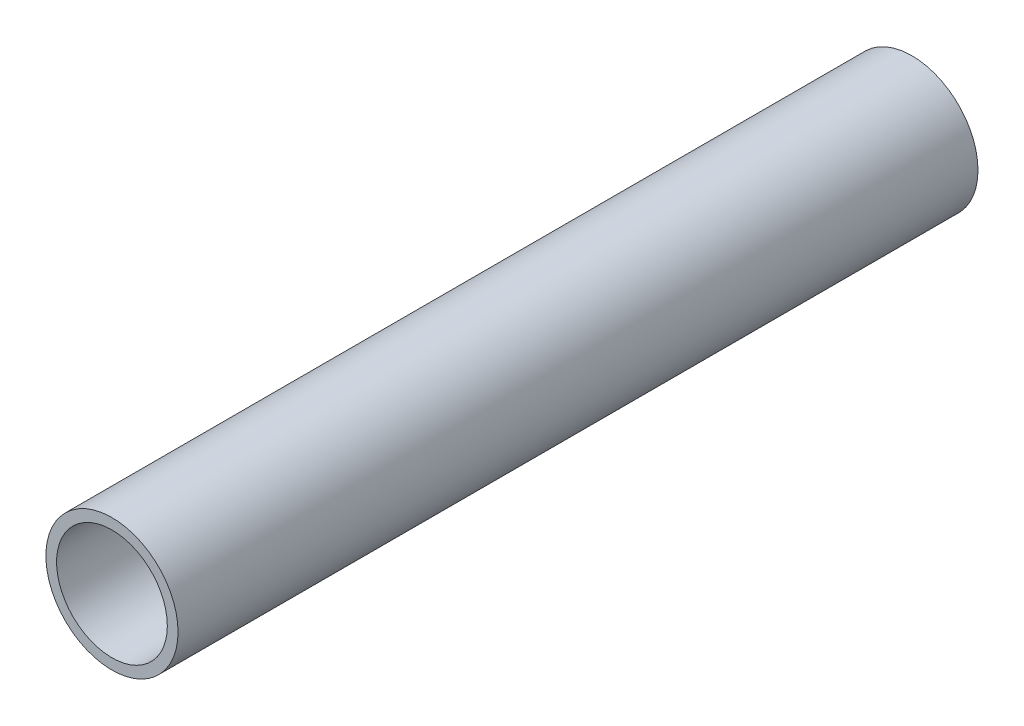
ISO-10303-21;
HEADER;
FILE_DESCRIPTION(('STEP AP214'),'2;1');
FILE_NAME('part.step','',(''),(''),'','','');
FILE_SCHEMA(('AUTOMOTIVE_DESIGN { 1 0 10303 214 1 1 1 1 }'));
ENDSEC;
DATA;
#1=APPLICATION_CONTEXT('core data for automotive mechanical design processes');
#2=APPLICATION_PROTOCOL_DEFINITION('international standard','automotive_design',2000,#1);
#3=PRODUCT_CONTEXT('',#1,'mechanical');
#4=PRODUCT('Part','Part','',(#3));
#5=PRODUCT_RELATED_PRODUCT_CATEGORY('part','',(#4));
#6=PRODUCT_DEFINITION_FORMATION('','',#4);
#7=PRODUCT_DEFINITION_CONTEXT('part definition',#1,'design');
#8=PRODUCT_DEFINITION('design','',#6,#7);
#9=PRODUCT_DEFINITION_SHAPE('','',#8);
#10=(LENGTH_UNIT() NAMED_UNIT(*) SI_UNIT(.MILLI.,.METRE.));
#11=(NAMED_UNIT(*) PLANE_ANGLE_UNIT() SI_UNIT($,.RADIAN.));
#12=(NAMED_UNIT(*) SI_UNIT($,.STERADIAN.) SOLID_ANGLE_UNIT());
#13=UNCERTAINTY_MEASURE_WITH_UNIT(LENGTH_MEASURE(1.E-05),#10,'distance_accuracy_value','');
#14=(GEOMETRIC_REPRESENTATION_CONTEXT(3) GLOBAL_UNCERTAINTY_ASSIGNED_CONTEXT((#13)) GLOBAL_UNIT_ASSIGNED_CONTEXT((#10,
#11,#12)) REPRESENTATION_CONTEXT('',''));
#15=CARTESIAN_POINT('',(0.,0.,0.));
#16=DIRECTION('',(0.,0.,1.));
#17=DIRECTION('',(1.,0.,0.));
#18=AXIS2_PLACEMENT_3D('',#15,#16,#17);
#19=CARTESIAN_POINT('',(-325.637336551959,52.4749999999989,-292.100000000003));
#20=DIRECTION('',(0.,0.,1.));
#21=DIRECTION('',(1.,0.,0.));
#22=AXIS2_PLACEMENT_3D('',#19,#20,#21);
#23=CYLINDRICAL_SURFACE('',#22,24.13);
#24=CARTESIAN_POINT('',(-325.637336551959,28.3449999999997,-53.9750000000048));
#25=CARTESIAN_POINT('',(-325.459818091288,28.3450025809268,-53.9749925082069));
#26=CARTESIAN_POINT('',(-325.28219064364,28.3469795891877,-53.9600618469458));
#27=CARTESIAN_POINT('',(-324.931883969958,28.3546760763637,-53.900739295128));
#28=CARTESIAN_POINT('',(-324.759210015163,28.3603993981656,-53.8563171521855));
#29=CARTESIAN_POINT('',(-324.423932015443,28.3749441395772,-53.7393477650123));
#30=CARTESIAN_POINT('',(-324.261321076704,28.3837634099955,-53.6668200279206));
#31=CARTESIAN_POINT('',(-323.950607923482,28.4035207348482,-53.4957422012726));
#32=CARTESIAN_POINT('',(-323.802503342963,28.4144584428887,-53.3971963650799));
#33=CARTESIAN_POINT('',(-323.524078031622,28.4373069469014,-53.1762403340289));
#34=CARTESIAN_POINT('',(-323.393858142176,28.4492227002004,-53.0537035692013));
#35=CARTESIAN_POINT('',(-323.155767560993,28.4726446368105,-52.7885160221119));
#36=CARTESIAN_POINT('',(-323.047898042619,28.4841507985924,-52.6458641844975));
#37=CARTESIAN_POINT('',(-322.857190190259,28.5054993413241,-52.3438347310911));
#38=CARTESIAN_POINT('',(-322.774447133869,28.5153353284868,-52.1843964640556));
#39=CARTESIAN_POINT('',(-322.6369495345,28.5321638027671,-51.8537359032831));
#40=CARTESIAN_POINT('',(-322.582193817437,28.5391564091635,-51.6825141042135));
#41=CARTESIAN_POINT('',(-322.502533409425,28.5494586349159,-51.3341972693994));
#42=CARTESIAN_POINT('',(-322.47745779969,28.5527893341109,-51.1571419574309));
#43=CARTESIAN_POINT('',(-322.457340377754,28.5554549917042,-50.8013073652497));
#44=CARTESIAN_POINT('',(-322.462297231484,28.554790127589,-50.6225281619659));
#45=CARTESIAN_POINT('',(-322.501963882523,28.549559070175,-50.2695157956141));
#46=CARTESIAN_POINT('',(-322.536484897098,28.5450176314487,-50.095261000624));
#47=CARTESIAN_POINT('',(-322.634005158554,28.5325837513708,-49.7550392213076));
#48=CARTESIAN_POINT('',(-322.697005039198,28.5246912354452,-49.5890724215118));
#49=CARTESIAN_POINT('',(-322.849895986417,28.5064165936053,-49.2695543243567));
#50=CARTESIAN_POINT('',(-322.939868577974,28.496026939242,-49.1160424852604));
#51=CARTESIAN_POINT('',(-323.144092701323,28.4739343907581,-48.8262245072506));
#52=CARTESIAN_POINT('',(-323.258345462822,28.4622314301372,-48.689919240348));
#53=CARTESIAN_POINT('',(-323.50893049819,28.4387210106488,-48.4372882523321));
#54=CARTESIAN_POINT('',(-323.645425393814,28.4269134387271,-48.3211237857034));
#55=CARTESIAN_POINT('',(-323.93606158404,28.4046080291005,-48.1133291727697));
#56=CARTESIAN_POINT('',(-324.090202927184,28.3941101949986,-48.0216990939552));
#57=CARTESIAN_POINT('',(-324.411884650194,28.3755995456255,-47.8655721796682));
#58=CARTESIAN_POINT('',(-324.579430269716,28.367587708145,-47.8010860168778));
#59=CARTESIAN_POINT('',(-324.923100831293,28.3549604337208,-47.7012084538364));
#60=CARTESIAN_POINT('',(-325.099225327509,28.350344820478,-47.6658155433342));
#61=CARTESIAN_POINT('',(-325.453660463131,28.3450530687133,-47.6253394904736));
#62=CARTESIAN_POINT('',(-325.631945333404,28.3443480735785,-47.6200343228712));
#63=CARTESIAN_POINT('',(-325.986861716846,28.3468789226747,-47.6392975871726));
#64=CARTESIAN_POINT('',(-326.163493269024,28.3501146736897,-47.6638653124515));
#65=CARTESIAN_POINT('',(-326.509429688578,28.3601455094139,-47.7419924749744));
#66=CARTESIAN_POINT('',(-326.678759004293,28.3669275243541,-47.7954454794534));
#67=CARTESIAN_POINT('',(-327.00605071904,28.3832919628254,-47.9297148226547));
#68=CARTESIAN_POINT('',(-327.164012694292,28.3928744906935,-48.0105321808907));
#69=CARTESIAN_POINT('',(-327.46507360711,28.4138444288795,-48.1977692822176));
#70=CARTESIAN_POINT('',(-327.608082942688,28.4252417902957,-48.3043319635166));
#71=CARTESIAN_POINT('',(-327.874266075466,28.4485368168047,-48.5398333672655));
#72=CARTESIAN_POINT('',(-327.997438996234,28.4604345039741,-48.6687730778738));
#73=CARTESIAN_POINT('',(-328.221245597148,28.4834788887001,-48.9463490537979));
#74=CARTESIAN_POINT('',(-328.321731683275,28.4946203563181,-49.0951048207546));
#75=CARTESIAN_POINT('',(-328.49629101121,28.514803141617,-49.4075131690926));
#76=CARTESIAN_POINT('',(-328.570364830005,28.523844505174,-49.5711654249555));
#77=CARTESIAN_POINT('',(-328.689760477435,28.5387671571531,-49.9082539491069));
#78=CARTESIAN_POINT('',(-328.735164151697,28.544657433666,-50.0816608129311));
#79=CARTESIAN_POINT('',(-328.796193539955,28.5526362892943,-50.4337203738645));
#80=CARTESIAN_POINT('',(-328.811820801745,28.5547250660134,-50.6123727978167));
#81=CARTESIAN_POINT('',(-328.812823288514,28.5548582497904,-50.9683832267383));
#82=CARTESIAN_POINT('',(-328.798430423827,28.5529336607729,-51.1457406114687));
#83=CARTESIAN_POINT('',(-328.740293759257,28.5453237990389,-51.4954913884167));
#84=CARTESIAN_POINT('',(-328.696549967198,28.5396385273248,-51.6678847819572));
#85=CARTESIAN_POINT('',(-328.581028083339,28.5251577848448,-52.002775065993));
#86=CARTESIAN_POINT('',(-328.509262418995,28.5163636929769,-52.1652763066948));
#87=CARTESIAN_POINT('',(-328.339756743501,28.4966540692591,-52.475967849785));
#88=CARTESIAN_POINT('',(-328.242016268634,28.4857384995364,-52.6241578966182));
#89=CARTESIAN_POINT('',(-328.022479210214,28.4629149274235,-52.9032043717282));
#90=CARTESIAN_POINT('',(-327.900509992928,28.4510001798414,-53.0339244415616));
#91=CARTESIAN_POINT('',(-327.636339854731,28.427579522979,-53.2731287135579));
#92=CARTESIAN_POINT('',(-327.494134189428,28.4160737103654,-53.381607686746));
#93=CARTESIAN_POINT('',(-327.192836095995,28.3947132903074,-53.5736447436199));
#94=CARTESIAN_POINT('',(-327.033675138078,28.3848658335742,-53.6570960584987));
#95=CARTESIAN_POINT('',(-326.703553587724,28.3680033383632,-53.7959646723369));
#96=CARTESIAN_POINT('',(-326.532605895658,28.3609852590454,-53.8514120844523));
#97=CARTESIAN_POINT('',(-326.240223894528,28.3522421558295,-53.9195956483082));
#98=CARTESIAN_POINT('',(-326.120624491511,28.3495397525192,-53.9403419628565));
#99=CARTESIAN_POINT('',(-325.879812519362,28.3459178006605,-53.9680466389509));
#100=CARTESIAN_POINT('',(-325.758599963949,28.3449982369604,-53.9750051176751));
#101=CARTESIAN_POINT('',(-325.637336551959,28.3449999999997,-53.9750000000048));
#102=B_SPLINE_CURVE_WITH_KNOTS('',3,(#24,#25,#26,#27,#28,#29,#30,#31,#32,#33,#34,#35,#36,#37,
#38,#39,#40,#41,#42,#43,#44,#45,#46,#47,#48,#49,#50,#51,#52,#53,#54,#55,#56,#57,#58,#59,#60,#61,
#62,#63,#64,#65,#66,#67,#68,#69,#70,#71,#72,#73,#74,#75,#76,#77,#78,#79,#80,#81,#82,#83,#84,#85,
#86,#87,#88,#89,#90,#91,#92,#93,#94,#95,#96,#97,#98,#99,#100,#101),.UNSPECIFIED.,.T.,.F.,(4,2,2,
2,2,2,2,2,2,2,2,2,2,2,2,2,2,2,2,2,2,2,2,2,2,2,2,2,2,2,2,2,2,2,2,2,2,2,4),(0.,0.532112403833518,
1.06477149414484,1.59706154411332,2.12926463066764,2.6643550611331,3.19947357597909,
3.73659658472221,4.27369705902272,4.80768924772236,5.34165771618489,5.8722417230875,
6.40283753806474,6.93505353031331,7.46729648388722,8.0036215643771,8.53994812020476,
9.07648535705787,9.61299474012437,10.1455398783179,10.6780724197284,11.2086560015707,
11.7392593535406,12.2728791985634,12.8065226139713,13.343543664941,13.8805529837315,
14.4160222695977,14.9514637207359,15.4827841248097,16.0141043872783,16.5451892810055,
17.0762836565789,17.6113074445635,18.1464568750005,18.6838578173005,19.2206796446554,
19.5841703700491,19.9476580062469),.UNSPECIFIED.);
#103=CARTESIAN_POINT('',(-325.637336551959,28.3449999999997,-53.9750000000048));
#104=VERTEX_POINT('',#103);
#105=EDGE_CURVE('E109',#104,#104,#102,.T.);
#106=ORIENTED_EDGE('',*,*,#105,.F.);
#107=EDGE_LOOP('',(#106));
#108=FACE_BOUND('',#107,.T.);
#109=CARTESIAN_POINT('',(-325.637336551959,28.3449999999991,-244.475000000002));
#110=CARTESIAN_POINT('',(-325.459818091288,28.3450025809262,-244.474992508204));
#111=CARTESIAN_POINT('',(-325.28219064364,28.3469795891872,-244.460061846946));
#112=CARTESIAN_POINT('',(-324.931883969958,28.3546760763633,-244.400739295129));
#113=CARTESIAN_POINT('',(-324.759210015163,28.360399398165,-244.356317152185));
#114=CARTESIAN_POINT('',(-324.423932015444,28.3749441395766,-244.239347765011));
#115=CARTESIAN_POINT('',(-324.261321076704,28.383763409995,-244.166820027921));
#116=CARTESIAN_POINT('',(-323.950607923482,28.4035207348477,-243.995742201275));
#117=CARTESIAN_POINT('',(-323.802503342963,28.4144584428882,-243.897196365083));
#118=CARTESIAN_POINT('',(-323.524078031623,28.437306946901,-243.676240334032));
#119=CARTESIAN_POINT('',(-323.393858142176,28.4492227001999,-243.553703569204));
#120=CARTESIAN_POINT('',(-323.155767560993,28.47264463681,-243.288516022113));
#121=CARTESIAN_POINT('',(-323.04789804262,28.4841507985919,-243.145864184498));
#122=CARTESIAN_POINT('',(-322.857190190259,28.5054993413236,-242.843834731091));
#123=CARTESIAN_POINT('',(-322.774447133868,28.5153353284864,-242.684396464056));
#124=CARTESIAN_POINT('',(-322.636949534499,28.5321638027668,-242.353735903283));
#125=CARTESIAN_POINT('',(-322.582193817437,28.5391564091631,-242.182514104213));
#126=CARTESIAN_POINT('',(-322.502533409425,28.5494586349154,-241.834197269399));
#127=CARTESIAN_POINT('',(-322.477457799689,28.5527893341104,-241.657141957431));
#128=CARTESIAN_POINT('',(-322.457340377753,28.555454991704,-241.30130736525));
#129=CARTESIAN_POINT('',(-322.462297231484,28.554790127589,-241.122528161966));
#130=CARTESIAN_POINT('',(-322.501963882523,28.5495590701749,-240.769515795614));
#131=CARTESIAN_POINT('',(-322.536484897098,28.5450176314484,-240.595261000624));
#132=CARTESIAN_POINT('',(-322.634005158554,28.5325837513703,-240.255039221307));
#133=CARTESIAN_POINT('',(-322.697005039197,28.524691235445,-240.089072421511));
#134=CARTESIAN_POINT('',(-322.849895986416,28.5064165936051,-239.769554324356));
#135=CARTESIAN_POINT('',(-322.939868577973,28.4960269392416,-239.616042485261));
#136=CARTESIAN_POINT('',(-323.144092701323,28.4739343907576,-239.326224507252));
#137=CARTESIAN_POINT('',(-323.258345462822,28.4622314301369,-239.18991924035));
#138=CARTESIAN_POINT('',(-323.50893049819,28.4387210106485,-238.937288252334));
#139=CARTESIAN_POINT('',(-323.645425393813,28.4269134387267,-238.821123785704));
#140=CARTESIAN_POINT('',(-323.936061584039,28.4046080291001,-238.613329172771));
#141=CARTESIAN_POINT('',(-324.090202927184,28.3941101949983,-238.521699093958));
#142=CARTESIAN_POINT('',(-324.411884650195,28.3755995456251,-238.365572179671));
#143=CARTESIAN_POINT('',(-324.579430269716,28.3675877081445,-238.301086016879));
#144=CARTESIAN_POINT('',(-324.923100831293,28.3549604337204,-238.201208453837));
#145=CARTESIAN_POINT('',(-325.09922532751,28.3503448204777,-238.165815543335));
#146=CARTESIAN_POINT('',(-325.453660463132,28.345053068713,-238.125339490475));
#147=CARTESIAN_POINT('',(-325.631945333404,28.344348073578,-238.120034322873));
#148=CARTESIAN_POINT('',(-325.986861716846,28.3468789226742,-238.139297587173));
#149=CARTESIAN_POINT('',(-326.163493269024,28.3501146736896,-238.16386531245));
#150=CARTESIAN_POINT('',(-326.509429688577,28.3601455094139,-238.241992474973));
#151=CARTESIAN_POINT('',(-326.678759004293,28.3669275243536,-238.295445479454));
#152=CARTESIAN_POINT('',(-327.00605071904,28.3832919628248,-238.429714822656));
#153=CARTESIAN_POINT('',(-327.164012694292,28.3928744906932,-238.510532180893));
#154=CARTESIAN_POINT('',(-327.46507360711,28.4138444288792,-238.69776928222));
#155=CARTESIAN_POINT('',(-327.608082942689,28.4252417902952,-238.804331963518));
#156=CARTESIAN_POINT('',(-327.874266075466,28.4485368168042,-239.039833367267));
#157=CARTESIAN_POINT('',(-327.997438996235,28.4604345039738,-239.168773077876));
#158=CARTESIAN_POINT('',(-328.221245597148,28.4834788886998,-239.4463490538));
#159=CARTESIAN_POINT('',(-328.321731683275,28.4946203563176,-239.595104820756));
#160=CARTESIAN_POINT('',(-328.496291011209,28.5148031416164,-239.907513169094));
#161=CARTESIAN_POINT('',(-328.570364830005,28.5238445051735,-240.071165424957));
#162=CARTESIAN_POINT('',(-328.689760477435,28.5387671571525,-240.408253949108));
#163=CARTESIAN_POINT('',(-328.735164151696,28.5446574336653,-240.581660812932));
#164=CARTESIAN_POINT('',(-328.796193539955,28.5526362892937,-240.933720373865));
#165=CARTESIAN_POINT('',(-328.811820801745,28.5547250660128,-241.112372797817));
#166=CARTESIAN_POINT('',(-328.812823288515,28.5548582497899,-241.468383226739));
#167=CARTESIAN_POINT('',(-328.798430423827,28.5529336607723,-241.645740611469));
#168=CARTESIAN_POINT('',(-328.740293759257,28.5453237990383,-241.995491388416));
#169=CARTESIAN_POINT('',(-328.696549967197,28.5396385273242,-242.167884781956));
#170=CARTESIAN_POINT('',(-328.581028083338,28.5251577848443,-242.502775065992));
#171=CARTESIAN_POINT('',(-328.509262418995,28.5163636929764,-242.665276306694));
#172=CARTESIAN_POINT('',(-328.339756743501,28.4966540692586,-242.975967849785));
#173=CARTESIAN_POINT('',(-328.242016268634,28.4857384995358,-243.124157896618));
#174=CARTESIAN_POINT('',(-328.022479210214,28.4629149274229,-243.403204371728));
#175=CARTESIAN_POINT('',(-327.900509992928,28.4510001798409,-243.533924441562));
#176=CARTESIAN_POINT('',(-327.636339854731,28.4275795229785,-243.773128713558));
#177=CARTESIAN_POINT('',(-327.494134189428,28.4160737103648,-243.881607686746));
#178=CARTESIAN_POINT('',(-327.192836095996,28.3947132903068,-244.07364474362));
#179=CARTESIAN_POINT('',(-327.033675138079,28.3848658335738,-244.157096058499));
#180=CARTESIAN_POINT('',(-326.703553587724,28.3680033383627,-244.295964672337));
#181=CARTESIAN_POINT('',(-326.532605895658,28.3609852590448,-244.35141208445));
#182=CARTESIAN_POINT('',(-326.240223894528,28.352242155829,-244.419595648308));
#183=CARTESIAN_POINT('',(-326.120624491511,28.3495397525187,-244.440341962858));
#184=CARTESIAN_POINT('',(-325.879812519362,28.34591780066,-244.468046638951));
#185=CARTESIAN_POINT('',(-325.758599963949,28.3449982369598,-244.475005117673));
#186=CARTESIAN_POINT('',(-325.637336551959,28.3449999999991,-244.475000000002));
#187=B_SPLINE_CURVE_WITH_KNOTS('',3,(#109,#110,#111,#112,#113,#114,#115,#116,#117,#118,#119,
#120,#121,#122,#123,#124,#125,#126,#127,#128,#129,#130,#131,#132,#133,#134,#135,#136,#137,#138,
#139,#140,#141,#142,#143,#144,#145,#146,#147,#148,#149,#150,#151,#152,#153,#154,#155,#156,#157,
#158,#159,#160,#161,#162,#163,#164,#165,#166,#167,#168,#169,#170,#171,#172,#173,#174,#175,#176,
#177,#178,#179,#180,#181,#182,#183,#184,#185,#186),.UNSPECIFIED.,.T.,.F.,(4,2,2,2,2,2,2,2,2,2,2,
2,2,2,2,2,2,2,2,2,2,2,2,2,2,2,2,2,2,2,2,2,2,2,2,2,2,2,4),(0.,0.532112403833292,1.06477149414452,
1.59706154411174,2.12926463066459,2.66435506113141,3.19947357597899,3.73659658472252,
4.27369705902306,4.80768924772265,5.34165771618534,5.87224172308816,6.40283753806534,
6.93505353031295,7.46729648388623,8.00362156437619,8.5399481202038,9.07648535705736,
9.61299474012445,10.1455398783175,10.678072419727,11.2086560015702,11.7392593535412,
12.2728791985639,12.8065226139716,13.343543664941,13.8805529837312,14.4160222695971,
14.9514637207348,15.4827841248079,16.0141043872759,16.5451892810033,17.0762836565769,
17.6113074445612,18.1464568749979,18.683857817298,19.220679644653,19.5841703700469,
19.9476580062451),.UNSPECIFIED.);
#188=CARTESIAN_POINT('',(-325.637336551959,28.3449999999991,-244.475000000002));
#189=VERTEX_POINT('',#188);
#190=EDGE_CURVE('E62',#189,#189,#187,.T.);
#191=ORIENTED_EDGE('',*,*,#190,.F.);
#192=EDGE_LOOP('',(#191));
#193=FACE_BOUND('',#192,.T.);
#194=CARTESIAN_POINT('',(-325.637336551959,52.4749999999989,-292.100000000003));
#195=DIRECTION('',(0.,0.,1.));
#196=DIRECTION('',(1.,0.,0.));
#197=AXIS2_PLACEMENT_3D('',#194,#195,#196);
#198=CIRCLE('',#197,24.13);
#199=CARTESIAN_POINT('',(-301.507336551959,52.4749999999989,-292.100000000003));
#200=VERTEX_POINT('',#199);
#201=EDGE_CURVE('E12',#200,#200,#198,.T.);
#202=ORIENTED_EDGE('',*,*,#201,.T.);
#203=EDGE_LOOP('',(#202));
#204=FACE_BOUND('',#203,.T.);
#205=CARTESIAN_POINT('',(-325.637336551959,52.4749999999999,-2.66453525910038E-12));
#206=DIRECTION('',(0.,0.,1.));
#207=DIRECTION('',(1.,0.,0.));
#208=AXIS2_PLACEMENT_3D('',#205,#206,#207);
#209=CIRCLE('',#208,24.13);
#210=CARTESIAN_POINT('',(-301.507336551959,52.4749999999999,-2.62435073672407E-12));
#211=VERTEX_POINT('',#210);
#212=EDGE_CURVE('E50',#211,#211,#209,.T.);
#213=ORIENTED_EDGE('',*,*,#212,.F.);
#214=EDGE_LOOP('',(#213));
#215=FACE_BOUND('',#214,.T.);
#216=ADVANCED_FACE('F46',(#108,#193,#204,#215),#23,.T.);
#217=CARTESIAN_POINT('',(-325.637336551959,52.4749999999989,-292.100000000003));
#218=DIRECTION('',(0.,0.,1.));
#219=DIRECTION('',(1.,0.,0.));
#220=AXIS2_PLACEMENT_3D('',#217,#218,#219);
#221=PLANE('',#220);
#222=CARTESIAN_POINT('',(-325.637336551959,52.4749999999989,-292.100000000003));
#223=DIRECTION('',(0.,0.,1.));
#224=DIRECTION('',(1.,0.,0.));
#225=AXIS2_PLACEMENT_3D('',#222,#223,#224);
#226=CIRCLE('',#225,20.2184);
#227=CARTESIAN_POINT('',(-305.418936551959,52.4749999999989,-292.100000000003));
#228=VERTEX_POINT('',#227);
#229=EDGE_CURVE('E57',#228,#228,#226,.T.);
#230=ORIENTED_EDGE('',*,*,#229,.T.);
#231=EDGE_LOOP('',(#230));
#232=FACE_BOUND('',#231,.T.);
#233=ORIENTED_EDGE('',*,*,#201,.F.);
#234=EDGE_LOOP('',(#233));
#235=FACE_BOUND('',#234,.T.);
#236=ADVANCED_FACE('F93',(#232,#235),#221,.F.);
#237=CARTESIAN_POINT('',(-325.637336551959,52.4749999999999,-2.66453525910038E-12));
#238=DIRECTION('',(0.,0.,1.));
#239=DIRECTION('',(1.,0.,0.));
#240=AXIS2_PLACEMENT_3D('',#237,#238,#239);
#241=PLANE('',#240);
#242=CARTESIAN_POINT('',(-325.637336551959,52.4749999999999,-2.66453525910038E-12));
#243=DIRECTION('',(0.,0.,1.));
#244=DIRECTION('',(1.,0.,0.));
#245=AXIS2_PLACEMENT_3D('',#242,#243,#244);
#246=CIRCLE('',#245,20.2184);
#247=CARTESIAN_POINT('',(-305.418936551959,52.4749999999999,-2.63086485929875E-12));
#248=VERTEX_POINT('',#247);
#249=EDGE_CURVE('E59',#248,#248,#246,.T.);
#250=ORIENTED_EDGE('',*,*,#249,.F.);
#251=EDGE_LOOP('',(#250));
#252=FACE_BOUND('',#251,.T.);
#253=ORIENTED_EDGE('',*,*,#212,.T.);
#254=EDGE_LOOP('',(#253));
#255=FACE_BOUND('',#254,.T.);
#256=ADVANCED_FACE('F91',(#252,#255),#241,.T.);
#257=CARTESIAN_POINT('',(-325.637336551959,52.4749999999989,-292.100000000003));
#258=DIRECTION('',(0.,0.,1.));
#259=DIRECTION('',(1.,0.,0.));
#260=AXIS2_PLACEMENT_3D('',#257,#258,#259);
#261=CYLINDRICAL_SURFACE('',#260,20.2184);
#262=CARTESIAN_POINT('',(-325.637336551958,32.2565999999996,-53.9750000000032));
#263=CARTESIAN_POINT('',(-325.460163926135,32.2566029278112,-53.9749927729527));
#264=CARTESIAN_POINT('',(-325.282890994419,32.2589531752092,-53.9601199337363));
#265=CARTESIAN_POINT('',(-324.933307103764,32.2681025349986,-53.9010405616043));
#266=CARTESIAN_POINT('',(-324.761001029207,32.2749058805131,-53.8568061169279));
#267=CARTESIAN_POINT('',(-324.426460038746,32.2921974903296,-53.7403637114216));
#268=CARTESIAN_POINT('',(-324.264217367896,32.3026828746448,-53.6681776090708));
#269=CARTESIAN_POINT('',(-323.954170524735,32.3261822834479,-53.4979359997102));
#270=CARTESIAN_POINT('',(-323.80636449619,32.3391959822053,-53.3998838245244));
#271=CARTESIAN_POINT('',(-323.52810278189,32.3664308223716,-53.1798028963141));
#272=CARTESIAN_POINT('',(-323.397788091089,32.3806604193125,-53.0575969022331));
#273=CARTESIAN_POINT('',(-323.159425288927,32.4086577136854,-52.793058782916));
#274=CARTESIAN_POINT('',(-323.051378508131,32.4224253834749,-52.6507254558755));
#275=CARTESIAN_POINT('',(-322.86006299503,32.4480219532804,-52.3490168418114));
#276=CARTESIAN_POINT('',(-322.776931926172,32.4598399252378,-52.1895532536991));
#277=CARTESIAN_POINT('',(-322.638687608347,32.4800827747638,-51.8587096552949));
#278=CARTESIAN_POINT('',(-322.583572683668,32.4885078552631,-51.687330358407));
#279=CARTESIAN_POINT('',(-322.503365689871,32.5009274217515,-51.3390079856382));
#280=CARTESIAN_POINT('',(-322.478031376898,32.504957637084,-51.1621219879604));
#281=CARTESIAN_POINT('',(-322.457354046068,32.5082394610721,-50.8065671746675));
#282=CARTESIAN_POINT('',(-322.46200914278,32.5074913701396,-50.6278984718361));
#283=CARTESIAN_POINT('',(-322.50098079188,32.5013337586338,-50.2755685914442));
#284=CARTESIAN_POINT('',(-322.53502659543,32.4959667888167,-50.1018766147861));
#285=CARTESIAN_POINT('',(-322.631388955247,32.4812426661879,-49.7627013433261));
#286=CARTESIAN_POINT('',(-322.693706381222,32.4718853906244,-49.5972183012266));
#287=CARTESIAN_POINT('',(-322.845121703211,32.450188407732,-49.2783400129539));
#288=CARTESIAN_POINT('',(-322.934333356176,32.4378360762546,-49.1249996770369));
#289=CARTESIAN_POINT('',(-323.136923829292,32.411549750937,-48.8353625964443));
#290=CARTESIAN_POINT('',(-323.250304385233,32.3976156435285,-48.6990670770295));
#291=CARTESIAN_POINT('',(-323.499495880634,32.3695482058583,-48.445820185739));
#292=CARTESIAN_POINT('',(-323.635539405683,32.3554143678663,-48.3290976099266));
#293=CARTESIAN_POINT('',(-323.925404854859,32.3286817886918,-48.120104580233));
#294=CARTESIAN_POINT('',(-324.079226870962,32.3160830554519,-48.0278342528643));
#295=CARTESIAN_POINT('',(-324.400488059776,32.2938251868537,-47.8703494732774));
#296=CARTESIAN_POINT('',(-324.567936549148,32.2841680845054,-47.8051537214943));
#297=CARTESIAN_POINT('',(-324.911591320664,32.2688982714988,-47.7038731551662));
#298=CARTESIAN_POINT('',(-325.087796952265,32.2632852608958,-47.6677861816403));
#299=CARTESIAN_POINT('',(-325.441990600833,32.2567760390099,-47.6260542108351));
#300=CARTESIAN_POINT('',(-325.619940716437,32.2558311220744,-47.620094854612));
#301=CARTESIAN_POINT('',(-325.974298120094,32.258631636747,-47.6379513657856));
#302=CARTESIAN_POINT('',(-326.150705460435,32.2623769087684,-47.6617662200963));
#303=CARTESIAN_POINT('',(-326.496009853419,32.2741068492996,-47.7382336973156));
#304=CARTESIAN_POINT('',(-326.664941883485,32.2820688464866,-47.7907321495128));
#305=CARTESIAN_POINT('',(-326.991606502537,32.3013426874425,-47.9229132790336));
#306=CARTESIAN_POINT('',(-327.149338522024,32.3126547014023,-48.0025973374979));
#307=CARTESIAN_POINT('',(-327.450501112754,32.3374933922157,-48.1876180557335));
#308=CARTESIAN_POINT('',(-327.593808526369,32.3510368991767,-48.2931528802902));
#309=CARTESIAN_POINT('',(-327.860790871152,32.3787814697397,-48.5266048475566));
#310=CARTESIAN_POINT('',(-327.984464544406,32.3929825753982,-48.6545234232666));
#311=CARTESIAN_POINT('',(-328.209821416046,32.4205974884801,-48.9305155671744));
#312=CARTESIAN_POINT('',(-328.311293191892,32.4340029094145,-49.0787627376933));
#313=CARTESIAN_POINT('',(-328.487893423425,32.4583568114373,-49.3903826725023));
#314=CARTESIAN_POINT('',(-328.563022643276,32.469305363793,-49.5537549978575));
#315=CARTESIAN_POINT('',(-328.684482120838,32.4874442550122,-49.8903733819097));
#316=CARTESIAN_POINT('',(-328.730921165075,32.4946487736659,-50.0635793898555));
#317=CARTESIAN_POINT('',(-328.794026764949,32.5045207103899,-50.4154546878609));
#318=CARTESIAN_POINT('',(-328.810695592631,32.5071884747018,-50.5941235599393));
#319=CARTESIAN_POINT('',(-328.813729709409,32.5076710930182,-50.9497439916703));
#320=CARTESIAN_POINT('',(-328.800427562942,32.5055392052068,-51.1266927306552));
#321=CARTESIAN_POINT('',(-328.744612639648,32.4967788751944,-51.4758023804989));
#322=CARTESIAN_POINT('',(-328.702099928262,32.4901504430672,-51.647963302083));
#323=CARTESIAN_POINT('',(-328.589192321897,32.4731631683529,-51.9825031637422));
#324=CARTESIAN_POINT('',(-328.518822889373,32.4628077332185,-52.1448908812977));
#325=CARTESIAN_POINT('',(-328.352232855548,32.4395294683692,-52.4556092996412));
#326=CARTESIAN_POINT('',(-328.256011210655,32.4266065350159,-52.6039394326308));
#327=CARTESIAN_POINT('',(-328.039248560005,32.399479094958,-52.8840179966747));
#328=CARTESIAN_POINT('',(-327.918461893747,32.3852625150196,-53.0155751572675));
#329=CARTESIAN_POINT('',(-327.656516925841,32.3572485684207,-53.2566695657854));
#330=CARTESIAN_POINT('',(-327.515353911226,32.3434512996413,-53.3662017053475));
#331=CARTESIAN_POINT('',(-327.215650880808,32.3177342962027,-53.560736677067));
#332=CARTESIAN_POINT('',(-327.057010622864,32.3058264619497,-53.6455866386041));
#333=CARTESIAN_POINT('',(-326.727613183746,32.2853462267488,-53.7873069461846));
#334=CARTESIAN_POINT('',(-326.55686855989,32.2767704272633,-53.8442058169294));
#335=CARTESIAN_POINT('',(-326.26072188964,32.2658429563329,-53.9157282908026));
#336=CARTESIAN_POINT('',(-326.137133474624,32.2623949443066,-53.9379205520459));
#337=CARTESIAN_POINT('',(-325.888158965998,32.2577724459489,-53.9675588596585));
#338=CARTESIAN_POINT('',(-325.762772898094,32.25659792714,-53.9750051166786));
#339=CARTESIAN_POINT('',(-325.637336551958,32.2565999999996,-53.9750000000032));
#340=B_SPLINE_CURVE_WITH_KNOTS('',3,(#262,#263,#264,#265,#266,#267,#268,#269,#270,#271,#272,
#273,#274,#275,#276,#277,#278,#279,#280,#281,#282,#283,#284,#285,#286,#287,#288,#289,#290,#291,
#292,#293,#294,#295,#296,#297,#298,#299,#300,#301,#302,#303,#304,#305,#306,#307,#308,#309,#310,
#311,#312,#313,#314,#315,#316,#317,#318,#319,#320,#321,#322,#323,#324,#325,#326,#327,#328,#329,
#330,#331,#332,#333,#334,#335,#336,#337,#338,#339),.UNSPECIFIED.,.T.,.F.,(4,2,2,2,2,2,2,2,2,2,2,
2,2,2,2,2,2,2,2,2,2,2,2,2,2,2,2,2,2,2,2,2,2,2,2,2,2,2,4),(0.,0.531059459532952,1.06262447976224,
1.59377464755679,2.12485643096511,2.6599905588189,3.19515665306761,3.73322731540492,
4.27126579067688,4.80489674115911,5.33849414261536,5.86722784127304,6.3959778062784,
6.92699642355557,7.45805319100914,7.99494014108685,8.5318298688877,9.06908981262833,
9.60630990444924,10.1379127695234,10.6694975469702,11.1982528358531,11.7270349916805,
12.2600049824463,12.7930091062668,13.3308870404992,13.8687493702994,14.4045595279464,
14.9403287911449,15.4701823563873,16.0000347345956,16.5294039150246,17.0587944680463,
17.5937653640232,18.1288601954731,18.6672018528477,19.2049929734816,19.5809828279941,
19.9569673113499),.UNSPECIFIED.);
#341=CARTESIAN_POINT('',(-325.637336551958,32.2565999999996,-53.9750000000032));
#342=VERTEX_POINT('',#341);
#343=EDGE_CURVE('E117',#342,#342,#340,.T.);
#344=ORIENTED_EDGE('',*,*,#343,.T.);
#345=EDGE_LOOP('',(#344));
#346=FACE_BOUND('',#345,.T.);
#347=CARTESIAN_POINT('',(-325.637336551958,32.2565999999991,-244.475000000004));
#348=CARTESIAN_POINT('',(-325.460163926135,32.2566029278107,-244.474992772954));
#349=CARTESIAN_POINT('',(-325.282890994419,32.2589531752088,-244.460119933737));
#350=CARTESIAN_POINT('',(-324.933307103764,32.2681025349981,-244.401040561605));
#351=CARTESIAN_POINT('',(-324.761001029207,32.2749058805126,-244.35680611693));
#352=CARTESIAN_POINT('',(-324.426460038745,32.2921974903291,-244.240363711424));
#353=CARTESIAN_POINT('',(-324.264217367895,32.3026828746444,-244.168177609072));
#354=CARTESIAN_POINT('',(-323.954170524734,32.3261822834475,-243.99793599971));
#355=CARTESIAN_POINT('',(-323.80636449619,32.3391959822048,-243.899883824522));
#356=CARTESIAN_POINT('',(-323.528102781889,32.3664308223712,-243.679802896311));
#357=CARTESIAN_POINT('',(-323.397788091087,32.3806604193123,-243.557596902232));
#358=CARTESIAN_POINT('',(-323.159425288925,32.4086577136852,-243.293058782915));
#359=CARTESIAN_POINT('',(-323.05137850813,32.4224253834745,-243.150725455875));
#360=CARTESIAN_POINT('',(-322.860062995029,32.4480219532799,-242.849016841811));
#361=CARTESIAN_POINT('',(-322.776931926172,32.4598399252374,-242.6895532537));
#362=CARTESIAN_POINT('',(-322.638687608347,32.4800827747634,-242.358709655297));
#363=CARTESIAN_POINT('',(-322.583572683669,32.4885078552626,-242.187330358409));
#364=CARTESIAN_POINT('',(-322.503365689872,32.5009274217511,-241.83900798564));
#365=CARTESIAN_POINT('',(-322.478031376897,32.5049576370837,-241.662121987962));
#366=CARTESIAN_POINT('',(-322.457354046068,32.5082394610718,-241.306567174669));
#367=CARTESIAN_POINT('',(-322.46200914278,32.5074913701392,-241.127898471837));
#368=CARTESIAN_POINT('',(-322.500980791881,32.5013337586333,-240.775568591444));
#369=CARTESIAN_POINT('',(-322.53502659543,32.4959667888163,-240.601876614786));
#370=CARTESIAN_POINT('',(-322.631388955246,32.4812426661875,-240.262701343326));
#371=CARTESIAN_POINT('',(-322.693706381222,32.471885390624,-240.097218301227));
#372=CARTESIAN_POINT('',(-322.845121703211,32.4501884077315,-239.778340012954));
#373=CARTESIAN_POINT('',(-322.934333356177,32.4378360762541,-239.624999677037));
#374=CARTESIAN_POINT('',(-323.136923829292,32.4115497509365,-239.335362596444));
#375=CARTESIAN_POINT('',(-323.250304385233,32.3976156435281,-239.199067077029));
#376=CARTESIAN_POINT('',(-323.499495880634,32.3695482058579,-238.945820185739));
#377=CARTESIAN_POINT('',(-323.635539405684,32.3554143678658,-238.829097609927));
#378=CARTESIAN_POINT('',(-323.925404854859,32.3286817886913,-238.620104580233));
#379=CARTESIAN_POINT('',(-324.079226870961,32.3160830554514,-238.527834252863));
#380=CARTESIAN_POINT('',(-324.400488059775,32.2938251868532,-238.370349473277));
#381=CARTESIAN_POINT('',(-324.567936549148,32.2841680845049,-238.305153721494));
#382=CARTESIAN_POINT('',(-324.911591320664,32.2688982714983,-238.203873155167));
#383=CARTESIAN_POINT('',(-325.087796952265,32.2632852608953,-238.167786181642));
#384=CARTESIAN_POINT('',(-325.441990600834,32.2567760390094,-238.126054210837));
#385=CARTESIAN_POINT('',(-325.619940716437,32.2558311220739,-238.120094854613));
#386=CARTESIAN_POINT('',(-325.974298120094,32.2586316367465,-238.137951365786));
#387=CARTESIAN_POINT('',(-326.150705460436,32.2623769087682,-238.161766220096));
#388=CARTESIAN_POINT('',(-326.496009853419,32.2741068492993,-238.238233697316));
#389=CARTESIAN_POINT('',(-326.664941883485,32.2820688464861,-238.290732149514));
#390=CARTESIAN_POINT('',(-326.991606502537,32.301342687442,-238.422913279034));
#391=CARTESIAN_POINT('',(-327.149338522024,32.312654701402,-238.502597337498));
#392=CARTESIAN_POINT('',(-327.450501112754,32.3374933922154,-238.687618055733));
#393=CARTESIAN_POINT('',(-327.593808526369,32.3510368991761,-238.793152880291));
#394=CARTESIAN_POINT('',(-327.860790871152,32.3787814697392,-239.026604847558));
#395=CARTESIAN_POINT('',(-327.984464544407,32.3929825753979,-239.154523423267));
#396=CARTESIAN_POINT('',(-328.209821416046,32.4205974884798,-239.430515567175));
#397=CARTESIAN_POINT('',(-328.311293191891,32.4340029094139,-239.578762737694));
#398=CARTESIAN_POINT('',(-328.487893423425,32.4583568114366,-239.890382672503));
#399=CARTESIAN_POINT('',(-328.563022643276,32.4693053637924,-240.053754997858));
#400=CARTESIAN_POINT('',(-328.684482120839,32.4874442550117,-240.39037338191));
#401=CARTESIAN_POINT('',(-328.730921165075,32.4946487736652,-240.563579389856));
#402=CARTESIAN_POINT('',(-328.794026764948,32.5045207103892,-240.915454687861));
#403=CARTESIAN_POINT('',(-328.810695592631,32.5071884747012,-241.09412355994));
#404=CARTESIAN_POINT('',(-328.813729709409,32.5076710930177,-241.44974399167));
#405=CARTESIAN_POINT('',(-328.800427562941,32.5055392052061,-241.626692730655));
#406=CARTESIAN_POINT('',(-328.744612639648,32.4967788751938,-241.975802380499));
#407=CARTESIAN_POINT('',(-328.702099928262,32.4901504430666,-242.147963302083));
#408=CARTESIAN_POINT('',(-328.589192321896,32.4731631683523,-242.482503163743));
#409=CARTESIAN_POINT('',(-328.518822889372,32.4628077332178,-242.644890881298));
#410=CARTESIAN_POINT('',(-328.352232855548,32.4395294683685,-242.955609299643));
#411=CARTESIAN_POINT('',(-328.256011210656,32.4266065350154,-243.103939432634));
#412=CARTESIAN_POINT('',(-328.039248560007,32.3994790949576,-243.384017996677));
#413=CARTESIAN_POINT('',(-327.918461893747,32.3852625150191,-243.515575157269));
#414=CARTESIAN_POINT('',(-327.656516925841,32.3572485684201,-243.756669565785));
#415=CARTESIAN_POINT('',(-327.515353911226,32.3434512996407,-243.866201705346));
#416=CARTESIAN_POINT('',(-327.215650880808,32.3177342962022,-244.060736677066));
#417=CARTESIAN_POINT('',(-327.057010622864,32.3058264619492,-244.145586638604));
#418=CARTESIAN_POINT('',(-326.727613183746,32.2853462267483,-244.287306946186));
#419=CARTESIAN_POINT('',(-326.556868559891,32.2767704272628,-244.344205816933));
#420=CARTESIAN_POINT('',(-326.260721889641,32.2658429563324,-244.415728290805));
#421=CARTESIAN_POINT('',(-326.137133474624,32.2623949443061,-244.437920552047));
#422=CARTESIAN_POINT('',(-325.888158965998,32.2577724459484,-244.467558859659));
#423=CARTESIAN_POINT('',(-325.762772898094,32.2565979271395,-244.475005116679));
#424=CARTESIAN_POINT('',(-325.637336551958,32.2565999999991,-244.475000000004));
#425=B_SPLINE_CURVE_WITH_KNOTS('',3,(#347,#348,#349,#350,#351,#352,#353,#354,#355,#356,#357,
#358,#359,#360,#361,#362,#363,#364,#365,#366,#367,#368,#369,#370,#371,#372,#373,#374,#375,#376,
#377,#378,#379,#380,#381,#382,#383,#384,#385,#386,#387,#388,#389,#390,#391,#392,#393,#394,#395,
#396,#397,#398,#399,#400,#401,#402,#403,#404,#405,#406,#407,#408,#409,#410,#411,#412,#413,#414,
#415,#416,#417,#418,#419,#420,#421,#422,#423,#424),.UNSPECIFIED.,.T.,.F.,(4,2,2,2,2,2,2,2,2,2,2,
2,2,2,2,2,2,2,2,2,2,2,2,2,2,2,2,2,2,2,2,2,2,2,2,2,2,2,4),(0.,0.531059459533134,1.06262447976183,
1.59377464755783,2.12485643096827,2.6599905588216,3.1951566530694,3.73322731540463,
4.27126579067484,4.80489674115833,5.3384941426158,5.86722784127371,6.39597780627925,
6.92699642355661,7.4580531910105,7.9949401410878,8.53182986888808,9.06908981262882,
9.60630990445016,10.1379127695243,10.6694975469708,11.1982528358537,11.7270349916808,
12.260004982447,12.7930091062678,13.3308870404997,13.8687493702994,14.4045595279465,
14.9403287911451,15.4701823563873,16.0000347345957,16.529403915026,17.0587944680482,
17.5937653640234,18.1288601954724,18.6672018528481,19.2049929734822,19.5809828279945,
19.9569673113507),.UNSPECIFIED.);
#426=CARTESIAN_POINT('',(-325.637336551958,32.2565999999991,-244.475000000004));
#427=VERTEX_POINT('',#426);
#428=EDGE_CURVE('E71',#427,#427,#425,.T.);
#429=ORIENTED_EDGE('',*,*,#428,.T.);
#430=EDGE_LOOP('',(#429));
#431=FACE_BOUND('',#430,.T.);
#432=ORIENTED_EDGE('',*,*,#229,.F.);
#433=EDGE_LOOP('',(#432));
#434=FACE_BOUND('',#433,.T.);
#435=ORIENTED_EDGE('',*,*,#249,.T.);
#436=EDGE_LOOP('',(#435));
#437=FACE_BOUND('',#436,.T.);
#438=ADVANCED_FACE('F82',(#346,#431,#434,#437),#261,.F.);
#439=CARTESIAN_POINT('',(-325.637336551957,28.3449999999991,-241.300000000003));
#440=DIRECTION('',(0.,-1.,0.));
#441=DIRECTION('',(0.,0.,-1.));
#442=AXIS2_PLACEMENT_3D('',#439,#440,#441);
#443=CYLINDRICAL_SURFACE('',#442,3.17499999999998);
#444=ORIENTED_EDGE('',*,*,#190,.T.);
#445=EDGE_LOOP('',(#444));
#446=FACE_BOUND('',#445,.T.);
#447=ORIENTED_EDGE('',*,*,#428,.F.);
#448=EDGE_LOOP('',(#447));
#449=FACE_BOUND('',#448,.T.);
#450=ADVANCED_FACE('F77',(#446,#449),#443,.F.);
#451=CARTESIAN_POINT('',(-325.637336551958,28.3449999999996,-50.800000000002));
#452=DIRECTION('',(0.,-1.,0.));
#453=DIRECTION('',(0.,0.,-1.));
#454=AXIS2_PLACEMENT_3D('',#451,#452,#453);
#455=CYLINDRICAL_SURFACE('',#454,3.17499999999998);
#456=ORIENTED_EDGE('',*,*,#105,.T.);
#457=EDGE_LOOP('',(#456));
#458=FACE_BOUND('',#457,.T.);
#459=ORIENTED_EDGE('',*,*,#343,.F.);
#460=EDGE_LOOP('',(#459));
#461=FACE_BOUND('',#460,.T.);
#462=ADVANCED_FACE('F81',(#458,#461),#455,.F.);
#463=CLOSED_SHELL('',(#216,#236,#256,#438,#450,#462));
#464=MANIFOLD_SOLID_BREP('B2',#463);
#465=ADVANCED_BREP_SHAPE_REPRESENTATION('',(#18,#464),#14);
#466=SHAPE_DEFINITION_REPRESENTATION(#9,#465);
ENDSEC;
END-ISO-10303-21;
